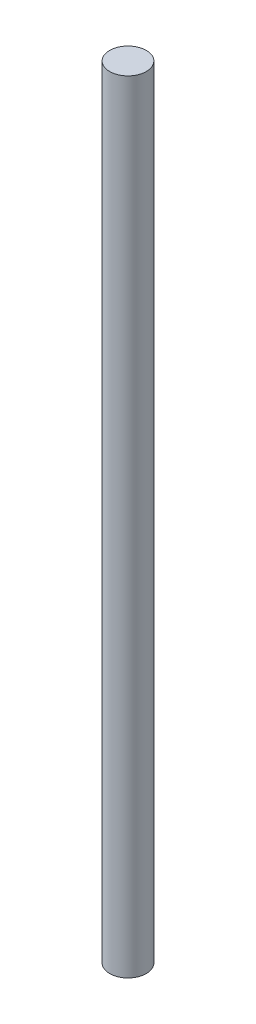
ISO-10303-21;
HEADER;
FILE_DESCRIPTION(('STEP AP214'),'2;1');
FILE_NAME('part.step','',(''),(''),'','','');
FILE_SCHEMA(('AUTOMOTIVE_DESIGN { 1 0 10303 214 1 1 1 1 }'));
ENDSEC;
DATA;
#1=APPLICATION_CONTEXT('core data for automotive mechanical design processes');
#2=APPLICATION_PROTOCOL_DEFINITION('international standard','automotive_design',2000,#1);
#3=PRODUCT_CONTEXT('',#1,'mechanical');
#4=PRODUCT('Part','Part','',(#3));
#5=PRODUCT_RELATED_PRODUCT_CATEGORY('part','',(#4));
#6=PRODUCT_DEFINITION_FORMATION('','',#4);
#7=PRODUCT_DEFINITION_CONTEXT('part definition',#1,'design');
#8=PRODUCT_DEFINITION('design','',#6,#7);
#9=PRODUCT_DEFINITION_SHAPE('','',#8);
#10=(LENGTH_UNIT() NAMED_UNIT(*) SI_UNIT(.MILLI.,.METRE.));
#11=(NAMED_UNIT(*) PLANE_ANGLE_UNIT() SI_UNIT($,.RADIAN.));
#12=(NAMED_UNIT(*) SI_UNIT($,.STERADIAN.) SOLID_ANGLE_UNIT());
#13=UNCERTAINTY_MEASURE_WITH_UNIT(LENGTH_MEASURE(1.E-05),#10,'distance_accuracy_value','');
#14=(GEOMETRIC_REPRESENTATION_CONTEXT(3) GLOBAL_UNCERTAINTY_ASSIGNED_CONTEXT((#13)) GLOBAL_UNIT_ASSIGNED_CONTEXT((#10,
#11,#12)) REPRESENTATION_CONTEXT('',''));
#15=CARTESIAN_POINT('',(0.,0.,0.));
#16=DIRECTION('',(0.,0.,1.));
#17=DIRECTION('',(1.,0.,0.));
#18=AXIS2_PLACEMENT_3D('',#15,#16,#17);
#19=CARTESIAN_POINT('',(0.,101.6,0.));
#20=DIRECTION('',(0.,-1.,0.));
#21=DIRECTION('',(0.,0.,-1.));
#22=AXIS2_PLACEMENT_3D('',#19,#20,#21);
#23=CYLINDRICAL_SURFACE('',#22,2.38125);
#24=CARTESIAN_POINT('',(0.,101.6,0.));
#25=DIRECTION('',(0.,1.,0.));
#26=DIRECTION('',(0.,0.,1.));
#27=AXIS2_PLACEMENT_3D('',#24,#25,#26);
#28=CIRCLE('',#27,2.38125);
#29=CARTESIAN_POINT('',(0.,101.6,2.38125));
#30=VERTEX_POINT('',#29);
#31=EDGE_CURVE('E10',#30,#30,#28,.T.);
#32=ORIENTED_EDGE('',*,*,#31,.F.);
#33=EDGE_LOOP('',(#32));
#34=FACE_BOUND('',#33,.T.);
#35=CARTESIAN_POINT('',(0.,0.,0.));
#36=DIRECTION('',(0.,1.,0.));
#37=DIRECTION('',(0.,0.,1.));
#38=AXIS2_PLACEMENT_3D('',#35,#36,#37);
#39=CIRCLE('',#38,2.38125);
#40=CARTESIAN_POINT('',(0.,0.,2.38125));
#41=VERTEX_POINT('',#40);
#42=EDGE_CURVE('E34',#41,#41,#39,.T.);
#43=ORIENTED_EDGE('',*,*,#42,.T.);
#44=EDGE_LOOP('',(#43));
#45=FACE_BOUND('',#44,.T.);
#46=ADVANCED_FACE('F31',(#34,#45),#23,.T.);
#47=CARTESIAN_POINT('',(0.,101.6,0.));
#48=DIRECTION('',(0.,1.,0.));
#49=DIRECTION('',(0.,0.,1.));
#50=AXIS2_PLACEMENT_3D('',#47,#48,#49);
#51=PLANE('',#50);
#52=ORIENTED_EDGE('',*,*,#31,.T.);
#53=EDGE_LOOP('',(#52));
#54=FACE_BOUND('',#53,.T.);
#55=ADVANCED_FACE('F46',(#54),#51,.T.);
#56=CARTESIAN_POINT('',(0.,0.,0.));
#57=DIRECTION('',(0.,1.,0.));
#58=DIRECTION('',(0.,0.,1.));
#59=AXIS2_PLACEMENT_3D('',#56,#57,#58);
#60=PLANE('',#59);
#61=ORIENTED_EDGE('',*,*,#42,.F.);
#62=EDGE_LOOP('',(#61));
#63=FACE_BOUND('',#62,.T.);
#64=ADVANCED_FACE('F44',(#63),#60,.F.);
#65=CLOSED_SHELL('',(#46,#55,#64));
#66=MANIFOLD_SOLID_BREP('B2',#65);
#67=ADVANCED_BREP_SHAPE_REPRESENTATION('',(#18,#66),#14);
#68=SHAPE_DEFINITION_REPRESENTATION(#9,#67);
ENDSEC;
END-ISO-10303-21;
